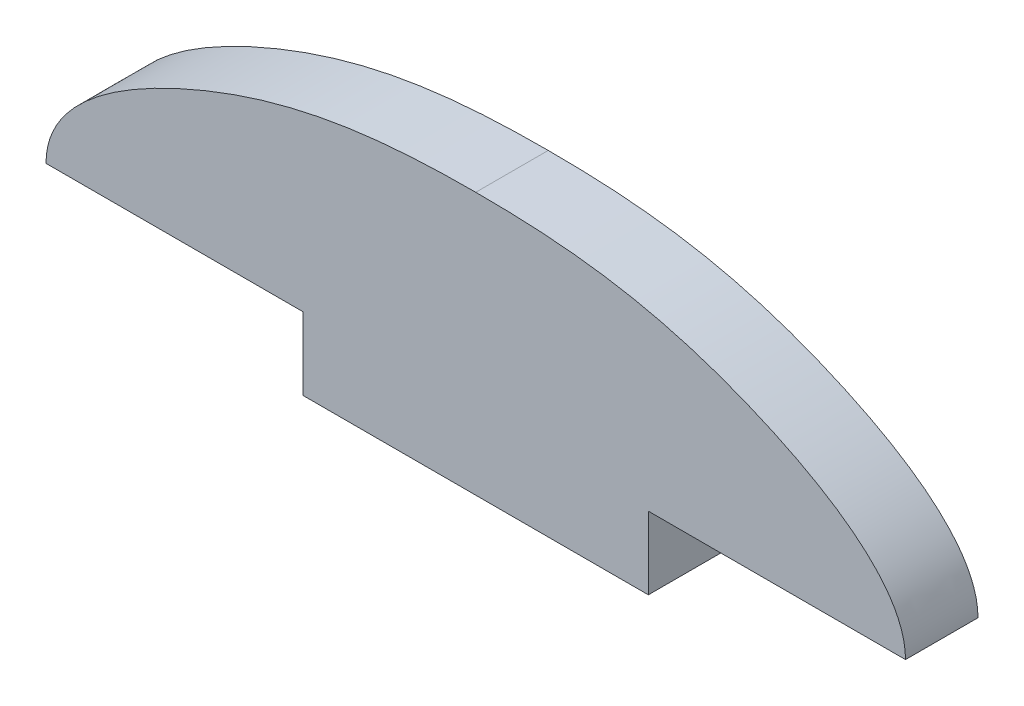
ISO-10303-21;
HEADER;
FILE_DESCRIPTION(('STEP AP214'),'2;1');
FILE_NAME('part.step','',(''),(''),'','','');
FILE_SCHEMA(('AUTOMOTIVE_DESIGN { 1 0 10303 214 1 1 1 1 }'));
ENDSEC;
DATA;
#1=APPLICATION_CONTEXT('core data for automotive mechanical design processes');
#2=APPLICATION_PROTOCOL_DEFINITION('international standard','automotive_design',2000,#1);
#3=PRODUCT_CONTEXT('',#1,'mechanical');
#4=PRODUCT('Part','Part','',(#3));
#5=PRODUCT_RELATED_PRODUCT_CATEGORY('part','',(#4));
#6=PRODUCT_DEFINITION_FORMATION('','',#4);
#7=PRODUCT_DEFINITION_CONTEXT('part definition',#1,'design');
#8=PRODUCT_DEFINITION('design','',#6,#7);
#9=PRODUCT_DEFINITION_SHAPE('','',#8);
#10=(LENGTH_UNIT() NAMED_UNIT(*) SI_UNIT(.MILLI.,.METRE.));
#11=(NAMED_UNIT(*) PLANE_ANGLE_UNIT() SI_UNIT($,.RADIAN.));
#12=(NAMED_UNIT(*) SI_UNIT($,.STERADIAN.) SOLID_ANGLE_UNIT());
#13=UNCERTAINTY_MEASURE_WITH_UNIT(LENGTH_MEASURE(1.E-05),#10,'distance_accuracy_value','');
#14=(GEOMETRIC_REPRESENTATION_CONTEXT(3) GLOBAL_UNCERTAINTY_ASSIGNED_CONTEXT((#13)) GLOBAL_UNIT_ASSIGNED_CONTEXT((#10,
#11,#12)) REPRESENTATION_CONTEXT('',''));
#15=CARTESIAN_POINT('',(0.,0.,0.));
#16=DIRECTION('',(0.,0.,1.));
#17=DIRECTION('',(1.,0.,0.));
#18=AXIS2_PLACEMENT_3D('',#15,#16,#17);
#19=CARTESIAN_POINT('',(12.7,0.,5.334));
#20=DIRECTION('',(-1.,0.,0.));
#21=DIRECTION('',(0.,0.,1.));
#22=AXIS2_PLACEMENT_3D('',#19,#20,#21);
#23=PLANE('',#22);
#24=DIRECTION('',(0.,1.,0.));
#25=VECTOR('',#24,1.);
#26=CARTESIAN_POINT('',(12.7,0.,0.));
#27=LINE('',#26,#25);
#28=CARTESIAN_POINT('',(12.7,36.1188,0.));
#29=VERTEX_POINT('',#28);
#30=CARTESIAN_POINT('',(12.7,41.4528,0.));
#31=VERTEX_POINT('',#30);
#32=EDGE_CURVE('E124',#29,#31,#27,.T.);
#33=ORIENTED_EDGE('',*,*,#32,.T.);
#34=DIRECTION('',(0.,0.,-1.));
#35=VECTOR('',#34,1.);
#36=CARTESIAN_POINT('',(12.7,41.4528,5.334));
#37=LINE('',#36,#35);
#38=CARTESIAN_POINT('',(12.7,41.4528,5.334));
#39=VERTEX_POINT('',#38);
#40=EDGE_CURVE('E11',#39,#31,#37,.T.);
#41=ORIENTED_EDGE('',*,*,#40,.F.);
#42=DIRECTION('',(0.,1.,0.));
#43=VECTOR('',#42,1.);
#44=CARTESIAN_POINT('',(12.7,0.,5.334));
#45=LINE('',#44,#43);
#46=CARTESIAN_POINT('',(12.7,36.1188,5.334));
#47=VERTEX_POINT('',#46);
#48=EDGE_CURVE('E148',#47,#39,#45,.T.);
#49=ORIENTED_EDGE('',*,*,#48,.F.);
#50=DIRECTION('',(0.,0.,-1.));
#51=VECTOR('',#50,1.);
#52=CARTESIAN_POINT('',(12.7,36.1188,5.334));
#53=LINE('',#52,#51);
#54=EDGE_CURVE('E120',#47,#29,#53,.T.);
#55=ORIENTED_EDGE('',*,*,#54,.T.);
#56=EDGE_LOOP('',(#33,#41,#49,#55));
#57=FACE_BOUND('',#56,.T.);
#58=ADVANCED_FACE('F35',(#57),#23,.F.);
#59=CARTESIAN_POINT('',(0.,41.4528,5.334));
#60=DIRECTION('',(0.,1.,0.));
#61=DIRECTION('',(0.,0.,1.));
#62=AXIS2_PLACEMENT_3D('',#59,#60,#61);
#63=PLANE('',#62);
#64=DIRECTION('',(1.,0.,0.));
#65=VECTOR('',#64,1.);
#66=CARTESIAN_POINT('',(0.,41.4528,0.));
#67=LINE('',#66,#65);
#68=CARTESIAN_POINT('',(31.623,41.4528,0.));
#69=VERTEX_POINT('',#68);
#70=EDGE_CURVE('E127',#31,#69,#67,.T.);
#71=ORIENTED_EDGE('',*,*,#70,.T.);
#72=DIRECTION('',(0.,0.,-1.));
#73=VECTOR('',#72,1.);
#74=CARTESIAN_POINT('',(31.623,41.4528,5.334));
#75=LINE('',#74,#73);
#76=CARTESIAN_POINT('',(31.623,41.4528,5.334));
#77=VERTEX_POINT('',#76);
#78=EDGE_CURVE('E43',#77,#69,#75,.T.);
#79=ORIENTED_EDGE('',*,*,#78,.F.);
#80=DIRECTION('',(1.,0.,0.));
#81=VECTOR('',#80,1.);
#82=CARTESIAN_POINT('',(0.,41.4528,5.334));
#83=LINE('',#82,#81);
#84=EDGE_CURVE('E91',#39,#77,#83,.T.);
#85=ORIENTED_EDGE('',*,*,#84,.F.);
#86=ORIENTED_EDGE('',*,*,#40,.T.);
#87=EDGE_LOOP('',(#71,#79,#85,#86));
#88=FACE_BOUND('',#87,.T.);
#89=ADVANCED_FACE('F183',(#88),#63,.F.);
#90=CARTESIAN_POINT('',(31.623,41.4528,5.334));
#91=CARTESIAN_POINT('',(31.623,45.8774172854211,5.334));
#92=CARTESIAN_POINT('',(17.9450303906727,54.2719735148985,5.334));
#93=CARTESIAN_POINT('',(6.99032810301992,55.4228,5.334));
#94=CARTESIAN_POINT('',(0.,55.4228,5.334));
#95=B_SPLINE_CURVE_WITH_KNOTS('',3,(#90,#91,#92,#93,#94),.UNSPECIFIED.,.F.,.F.,(4,1,4),(0.,
0.410117749210635,1.),.UNSPECIFIED.);
#96=DIRECTION('',(0.,0.,-1.));
#97=VECTOR('',#96,1.);
#98=SURFACE_OF_LINEAR_EXTRUSION('',#95,#97);
#99=CARTESIAN_POINT('',(31.623,41.4528,0.));
#100=CARTESIAN_POINT('',(31.623,45.8774172854211,0.));
#101=CARTESIAN_POINT('',(17.9450303906727,54.2719735148985,0.));
#102=CARTESIAN_POINT('',(6.99032810301992,55.4228,0.));
#103=CARTESIAN_POINT('',(0.,55.4228,0.));
#104=B_SPLINE_CURVE_WITH_KNOTS('',3,(#99,#100,#101,#102,#103),.UNSPECIFIED.,.F.,.F.,(4,1,4),(0.,
0.410117749210635,1.),.UNSPECIFIED.);
#105=CARTESIAN_POINT('',(0.,55.4228,0.));
#106=VERTEX_POINT('',#105);
#107=EDGE_CURVE('E129',#69,#106,#104,.T.);
#108=ORIENTED_EDGE('',*,*,#107,.T.);
#109=DIRECTION('',(0.,0.,-1.));
#110=VECTOR('',#109,1.);
#111=CARTESIAN_POINT('',(0.,55.4228,5.334));
#112=LINE('',#111,#110);
#113=CARTESIAN_POINT('',(0.,55.4228,5.334));
#114=VERTEX_POINT('',#113);
#115=EDGE_CURVE('E152',#114,#106,#112,.T.);
#116=ORIENTED_EDGE('',*,*,#115,.F.);
#117=EDGE_CURVE('E159',#77,#114,#95,.T.);
#118=ORIENTED_EDGE('',*,*,#117,.F.);
#119=ORIENTED_EDGE('',*,*,#78,.T.);
#120=EDGE_LOOP('',(#108,#116,#118,#119));
#121=FACE_BOUND('',#120,.T.);
#122=ADVANCED_FACE('F157',(#121),#98,.F.);
#123=CARTESIAN_POINT('',(-31.623,41.4528,5.334));
#124=CARTESIAN_POINT('',(-31.623,45.8774172854211,5.334));
#125=CARTESIAN_POINT('',(-17.9450303906727,54.2719735148985,5.334));
#126=CARTESIAN_POINT('',(-6.99032810301991,55.4228,5.334));
#127=CARTESIAN_POINT('',(0.,55.4228,5.334));
#128=B_SPLINE_CURVE_WITH_KNOTS('',3,(#123,#124,#125,#126,#127),.UNSPECIFIED.,.F.,.F.,(4,1,4),
(0.,0.410117749210635,1.),.UNSPECIFIED.);
#129=DIRECTION('',(0.,0.,-1.));
#130=VECTOR('',#129,1.);
#131=SURFACE_OF_LINEAR_EXTRUSION('',#128,#130);
#132=CARTESIAN_POINT('',(-31.623,41.4528,0.));
#133=CARTESIAN_POINT('',(-31.623,45.8774172854211,0.));
#134=CARTESIAN_POINT('',(-17.9450303906727,54.2719735148985,0.));
#135=CARTESIAN_POINT('',(-6.99032810301991,55.4228,0.));
#136=CARTESIAN_POINT('',(0.,55.4228,0.));
#137=B_SPLINE_CURVE_WITH_KNOTS('',3,(#132,#133,#134,#135,#136),.UNSPECIFIED.,.F.,.F.,(4,1,4),
(0.,0.410117749210635,1.),.UNSPECIFIED.);
#138=CARTESIAN_POINT('',(-31.623,41.4528,0.));
#139=VERTEX_POINT('',#138);
#140=EDGE_CURVE('E134',#139,#106,#137,.T.);
#141=ORIENTED_EDGE('',*,*,#140,.F.);
#142=DIRECTION('',(0.,0.,-1.));
#143=VECTOR('',#142,1.);
#144=CARTESIAN_POINT('',(-31.623,41.4528,5.334));
#145=LINE('',#144,#143);
#146=CARTESIAN_POINT('',(-31.623,41.4528,5.334));
#147=VERTEX_POINT('',#146);
#148=EDGE_CURVE('E115',#147,#139,#145,.T.);
#149=ORIENTED_EDGE('',*,*,#148,.F.);
#150=EDGE_CURVE('E108',#147,#114,#128,.T.);
#151=ORIENTED_EDGE('',*,*,#150,.T.);
#152=ORIENTED_EDGE('',*,*,#115,.T.);
#153=EDGE_LOOP('',(#141,#149,#151,#152));
#154=FACE_BOUND('',#153,.T.);
#155=ADVANCED_FACE('F165',(#154),#131,.T.);
#156=CARTESIAN_POINT('',(0.,41.4528,5.334));
#157=DIRECTION('',(0.,1.,0.));
#158=DIRECTION('',(0.,0.,1.));
#159=AXIS2_PLACEMENT_3D('',#156,#157,#158);
#160=PLANE('',#159);
#161=DIRECTION('',(1.,0.,0.));
#162=VECTOR('',#161,1.);
#163=CARTESIAN_POINT('',(0.,41.4528,0.));
#164=LINE('',#163,#162);
#165=CARTESIAN_POINT('',(-12.7,41.4528,0.));
#166=VERTEX_POINT('',#165);
#167=EDGE_CURVE('E114',#139,#166,#164,.T.);
#168=ORIENTED_EDGE('',*,*,#167,.T.);
#169=DIRECTION('',(0.,0.,-1.));
#170=VECTOR('',#169,1.);
#171=CARTESIAN_POINT('',(-12.7,41.4528,5.334));
#172=LINE('',#171,#170);
#173=CARTESIAN_POINT('',(-12.7,41.4528,5.334));
#174=VERTEX_POINT('',#173);
#175=EDGE_CURVE('E111',#174,#166,#172,.T.);
#176=ORIENTED_EDGE('',*,*,#175,.F.);
#177=DIRECTION('',(1.,0.,0.));
#178=VECTOR('',#177,1.);
#179=CARTESIAN_POINT('',(0.,41.4528,5.334));
#180=LINE('',#179,#178);
#181=EDGE_CURVE('E102',#147,#174,#180,.T.);
#182=ORIENTED_EDGE('',*,*,#181,.F.);
#183=ORIENTED_EDGE('',*,*,#148,.T.);
#184=EDGE_LOOP('',(#168,#176,#182,#183));
#185=FACE_BOUND('',#184,.T.);
#186=ADVANCED_FACE('F112',(#185),#160,.F.);
#187=CARTESIAN_POINT('',(-12.7,0.,5.334));
#188=DIRECTION('',(1.,0.,0.));
#189=DIRECTION('',(0.,0.,-1.));
#190=AXIS2_PLACEMENT_3D('',#187,#188,#189);
#191=PLANE('',#190);
#192=DIRECTION('',(0.,-1.,0.));
#193=VECTOR('',#192,1.);
#194=CARTESIAN_POINT('',(-12.7,0.,0.));
#195=LINE('',#194,#193);
#196=CARTESIAN_POINT('',(-12.7,36.1188,0.));
#197=VERTEX_POINT('',#196);
#198=EDGE_CURVE('E77',#166,#197,#195,.T.);
#199=ORIENTED_EDGE('',*,*,#198,.T.);
#200=DIRECTION('',(0.,0.,-1.));
#201=VECTOR('',#200,1.);
#202=CARTESIAN_POINT('',(-12.7,36.1188,5.334));
#203=LINE('',#202,#201);
#204=CARTESIAN_POINT('',(-12.7,36.1188,5.334));
#205=VERTEX_POINT('',#204);
#206=EDGE_CURVE('E116',#205,#197,#203,.T.);
#207=ORIENTED_EDGE('',*,*,#206,.F.);
#208=DIRECTION('',(0.,-1.,0.));
#209=VECTOR('',#208,1.);
#210=CARTESIAN_POINT('',(-12.7,0.,5.334));
#211=LINE('',#210,#209);
#212=EDGE_CURVE('E106',#174,#205,#211,.T.);
#213=ORIENTED_EDGE('',*,*,#212,.F.);
#214=ORIENTED_EDGE('',*,*,#175,.T.);
#215=EDGE_LOOP('',(#199,#207,#213,#214));
#216=FACE_BOUND('',#215,.T.);
#217=ADVANCED_FACE('F118',(#216),#191,.F.);
#218=CARTESIAN_POINT('',(0.,36.1188,5.334));
#219=DIRECTION('',(0.,1.,0.));
#220=DIRECTION('',(-1.,0.,0.));
#221=AXIS2_PLACEMENT_3D('',#218,#219,#220);
#222=PLANE('',#221);
#223=DIRECTION('',(1.,0.,0.));
#224=VECTOR('',#223,1.);
#225=CARTESIAN_POINT('',(0.,36.1188,0.));
#226=LINE('',#225,#224);
#227=EDGE_CURVE('E83',#197,#29,#226,.T.);
#228=ORIENTED_EDGE('',*,*,#227,.T.);
#229=ORIENTED_EDGE('',*,*,#54,.F.);
#230=DIRECTION('',(1.,0.,0.));
#231=VECTOR('',#230,1.);
#232=CARTESIAN_POINT('',(0.,36.1188,5.334));
#233=LINE('',#232,#231);
#234=EDGE_CURVE('E51',#205,#47,#233,.T.);
#235=ORIENTED_EDGE('',*,*,#234,.F.);
#236=ORIENTED_EDGE('',*,*,#206,.T.);
#237=EDGE_LOOP('',(#228,#229,#235,#236));
#238=FACE_BOUND('',#237,.T.);
#239=ADVANCED_FACE('F191',(#238),#222,.F.);
#240=CARTESIAN_POINT('',(0.,0.,5.334));
#241=DIRECTION('',(0.,0.,1.));
#242=DIRECTION('',(1.,0.,0.));
#243=AXIS2_PLACEMENT_3D('',#240,#241,#242);
#244=PLANE('',#243);
#245=ORIENTED_EDGE('',*,*,#48,.T.);
#246=ORIENTED_EDGE('',*,*,#84,.T.);
#247=ORIENTED_EDGE('',*,*,#117,.T.);
#248=ORIENTED_EDGE('',*,*,#150,.F.);
#249=ORIENTED_EDGE('',*,*,#181,.T.);
#250=ORIENTED_EDGE('',*,*,#212,.T.);
#251=ORIENTED_EDGE('',*,*,#234,.T.);
#252=EDGE_LOOP('',(#245,#246,#247,#248,#249,#250,#251));
#253=FACE_BOUND('',#252,.T.);
#254=ADVANCED_FACE('F104',(#253),#244,.T.);
#255=CARTESIAN_POINT('',(0.,0.,0.));
#256=DIRECTION('',(0.,0.,1.));
#257=DIRECTION('',(1.,0.,0.));
#258=AXIS2_PLACEMENT_3D('',#255,#256,#257);
#259=PLANE('',#258);
#260=ORIENTED_EDGE('',*,*,#32,.F.);
#261=ORIENTED_EDGE('',*,*,#227,.F.);
#262=ORIENTED_EDGE('',*,*,#198,.F.);
#263=ORIENTED_EDGE('',*,*,#167,.F.);
#264=ORIENTED_EDGE('',*,*,#140,.T.);
#265=ORIENTED_EDGE('',*,*,#107,.F.);
#266=ORIENTED_EDGE('',*,*,#70,.F.);
#267=EDGE_LOOP('',(#260,#261,#262,#263,#264,#265,#266));
#268=FACE_BOUND('',#267,.T.);
#269=ADVANCED_FACE('F162',(#268),#259,.F.);
#270=CLOSED_SHELL('',(#58,#89,#122,#155,#186,#217,#239,#254,#269));
#271=MANIFOLD_SOLID_BREP('B2',#270);
#272=ADVANCED_BREP_SHAPE_REPRESENTATION('',(#18,#271),#14);
#273=SHAPE_DEFINITION_REPRESENTATION(#9,#272);
ENDSEC;
END-ISO-10303-21;
